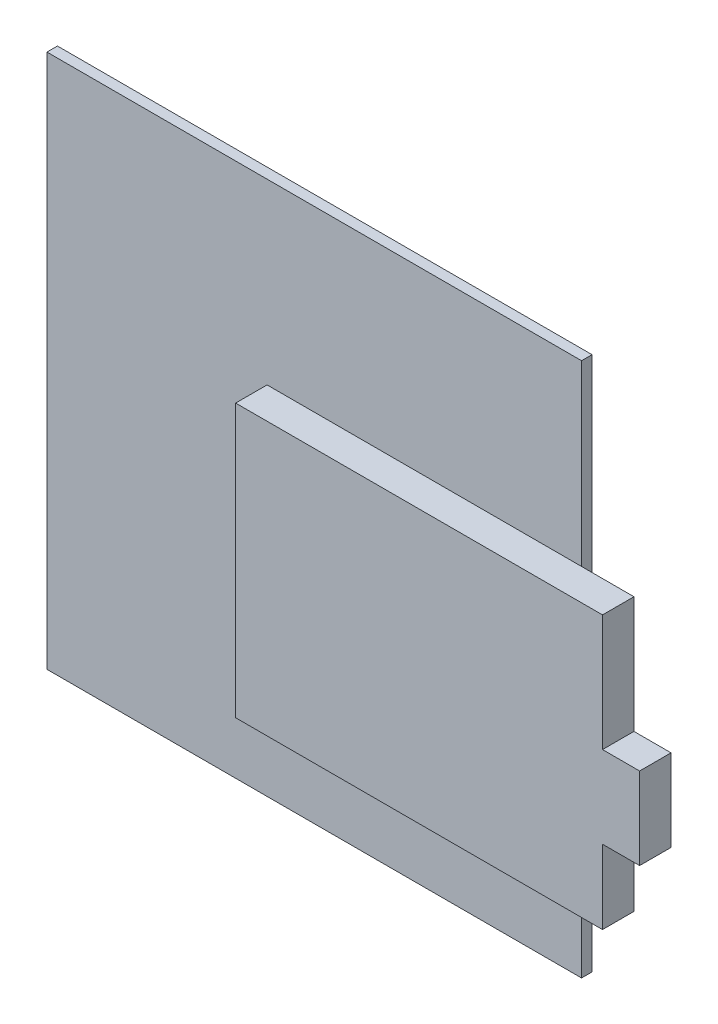
ISO-10303-21;
HEADER;
FILE_DESCRIPTION(('STEP AP214'),'2;1');
FILE_NAME('part.step','',(''),(''),'','','');
FILE_SCHEMA(('AUTOMOTIVE_DESIGN { 1 0 10303 214 1 1 1 1 }'));
ENDSEC;
DATA;
#1=APPLICATION_CONTEXT('core data for automotive mechanical design processes');
#2=APPLICATION_PROTOCOL_DEFINITION('international standard','automotive_design',2000,#1);
#3=PRODUCT_CONTEXT('',#1,'mechanical');
#4=PRODUCT('Part','Part','',(#3));
#5=PRODUCT_RELATED_PRODUCT_CATEGORY('part','',(#4));
#6=PRODUCT_DEFINITION_FORMATION('','',#4);
#7=PRODUCT_DEFINITION_CONTEXT('part definition',#1,'design');
#8=PRODUCT_DEFINITION('design','',#6,#7);
#9=PRODUCT_DEFINITION_SHAPE('','',#8);
#10=(LENGTH_UNIT() NAMED_UNIT(*) SI_UNIT(.MILLI.,.METRE.));
#11=(NAMED_UNIT(*) PLANE_ANGLE_UNIT() SI_UNIT($,.RADIAN.));
#12=(NAMED_UNIT(*) SI_UNIT($,.STERADIAN.) SOLID_ANGLE_UNIT());
#13=UNCERTAINTY_MEASURE_WITH_UNIT(LENGTH_MEASURE(1.E-05),#10,'distance_accuracy_value','');
#14=(GEOMETRIC_REPRESENTATION_CONTEXT(3) GLOBAL_UNCERTAINTY_ASSIGNED_CONTEXT((#13)) GLOBAL_UNIT_ASSIGNED_CONTEXT((#10,
#11,#12)) REPRESENTATION_CONTEXT('',''));
#15=CARTESIAN_POINT('',(0.,0.,0.));
#16=DIRECTION('',(0.,0.,1.));
#17=DIRECTION('',(1.,0.,0.));
#18=AXIS2_PLACEMENT_3D('',#15,#16,#17);
#19=CARTESIAN_POINT('',(0.,0.,1.));
#20=DIRECTION('',(1.,0.,0.));
#21=DIRECTION('',(0.,0.,-1.));
#22=AXIS2_PLACEMENT_3D('',#19,#20,#21);
#23=PLANE('',#22);
#24=DIRECTION('',(0.,-1.,0.));
#25=VECTOR('',#24,1.);
#26=CARTESIAN_POINT('',(0.,0.,1.));
#27=LINE('',#26,#25);
#28=CARTESIAN_POINT('',(0.,-1.,1.));
#29=VERTEX_POINT('',#28);
#30=CARTESIAN_POINT('',(0.,-52.,1.));
#31=VERTEX_POINT('',#30);
#32=EDGE_CURVE('E146',#29,#31,#27,.T.);
#33=ORIENTED_EDGE('',*,*,#32,.F.);
#34=DIRECTION('',(0.,0.,1.));
#35=VECTOR('',#34,1.);
#36=CARTESIAN_POINT('',(0.,-1.,-2.));
#37=LINE('',#36,#35);
#38=CARTESIAN_POINT('',(0.,-1.,0.));
#39=VERTEX_POINT('',#38);
#40=EDGE_CURVE('E134',#39,#29,#37,.T.);
#41=ORIENTED_EDGE('',*,*,#40,.F.);
#42=DIRECTION('',(0.,-1.,0.));
#43=VECTOR('',#42,1.);
#44=CARTESIAN_POINT('',(0.,0.,0.));
#45=LINE('',#44,#43);
#46=CARTESIAN_POINT('',(0.,-52.,0.));
#47=VERTEX_POINT('',#46);
#48=EDGE_CURVE('E175',#39,#47,#45,.T.);
#49=ORIENTED_EDGE('',*,*,#48,.T.);
#50=DIRECTION('',(0.,0.,-1.));
#51=VECTOR('',#50,1.);
#52=CARTESIAN_POINT('',(0.,-52.,1.));
#53=LINE('',#52,#51);
#54=EDGE_CURVE('E49',#31,#47,#53,.T.);
#55=ORIENTED_EDGE('',*,*,#54,.F.);
#56=EDGE_LOOP('',(#33,#41,#49,#55));
#57=FACE_BOUND('',#56,.T.);
#58=ADVANCED_FACE('F41',(#57),#23,.F.);
#59=CARTESIAN_POINT('',(0.,-52.,1.));
#60=DIRECTION('',(0.,1.,0.));
#61=DIRECTION('',(0.,0.,1.));
#62=AXIS2_PLACEMENT_3D('',#59,#60,#61);
#63=PLANE('',#62);
#64=DIRECTION('',(1.,0.,0.));
#65=VECTOR('',#64,1.);
#66=CARTESIAN_POINT('',(0.,-52.,0.));
#67=LINE('',#66,#65);
#68=CARTESIAN_POINT('',(51.,-52.,0.));
#69=VERTEX_POINT('',#68);
#70=EDGE_CURVE('E163',#47,#69,#67,.T.);
#71=ORIENTED_EDGE('',*,*,#70,.T.);
#72=DIRECTION('',(0.,0.,-1.));
#73=VECTOR('',#72,1.);
#74=CARTESIAN_POINT('',(51.,-52.,1.));
#75=LINE('',#74,#73);
#76=CARTESIAN_POINT('',(51.,-52.,1.));
#77=VERTEX_POINT('',#76);
#78=EDGE_CURVE('E173',#77,#69,#75,.T.);
#79=ORIENTED_EDGE('',*,*,#78,.F.);
#80=DIRECTION('',(1.,0.,0.));
#81=VECTOR('',#80,1.);
#82=CARTESIAN_POINT('',(0.,-52.,1.));
#83=LINE('',#82,#81);
#84=EDGE_CURVE('E156',#31,#77,#83,.T.);
#85=ORIENTED_EDGE('',*,*,#84,.F.);
#86=ORIENTED_EDGE('',*,*,#54,.T.);
#87=EDGE_LOOP('',(#71,#79,#85,#86));
#88=FACE_BOUND('',#87,.T.);
#89=ADVANCED_FACE('F184',(#88),#63,.F.);
#90=CARTESIAN_POINT('',(51.,0.,1.));
#91=DIRECTION('',(-1.,0.,0.));
#92=DIRECTION('',(0.,-1.,0.));
#93=AXIS2_PLACEMENT_3D('',#90,#91,#92);
#94=PLANE('',#93);
#95=DIRECTION('',(0.,1.,0.));
#96=VECTOR('',#95,1.);
#97=CARTESIAN_POINT('',(51.,0.,0.));
#98=LINE('',#97,#96);
#99=CARTESIAN_POINT('',(51.,-1.,0.));
#100=VERTEX_POINT('',#99);
#101=EDGE_CURVE('E157',#69,#100,#98,.T.);
#102=ORIENTED_EDGE('',*,*,#101,.T.);
#103=DIRECTION('',(0.,0.,1.));
#104=VECTOR('',#103,1.);
#105=CARTESIAN_POINT('',(51.,-1.,-2.));
#106=LINE('',#105,#104);
#107=CARTESIAN_POINT('',(51.,-1.,1.));
#108=VERTEX_POINT('',#107);
#109=EDGE_CURVE('E56',#100,#108,#106,.T.);
#110=ORIENTED_EDGE('',*,*,#109,.T.);
#111=DIRECTION('',(0.,1.,0.));
#112=VECTOR('',#111,1.);
#113=CARTESIAN_POINT('',(51.,0.,1.));
#114=LINE('',#113,#112);
#115=CARTESIAN_POINT('',(51.,-18.,1.));
#116=VERTEX_POINT('',#115);
#117=EDGE_CURVE('E150',#116,#108,#114,.T.);
#118=ORIENTED_EDGE('',*,*,#117,.F.);
#119=CARTESIAN_POINT('',(51.,-44.,1.));
#120=VERTEX_POINT('',#119);
#121=EDGE_CURVE('E174',#120,#116,#114,.T.);
#122=ORIENTED_EDGE('',*,*,#121,.F.);
#123=EDGE_CURVE('E169',#77,#120,#114,.T.);
#124=ORIENTED_EDGE('',*,*,#123,.F.);
#125=ORIENTED_EDGE('',*,*,#78,.T.);
#126=EDGE_LOOP('',(#102,#110,#118,#122,#124,#125));
#127=FACE_BOUND('',#126,.T.);
#128=ADVANCED_FACE('F194',(#127),#94,.F.);
#129=CARTESIAN_POINT('',(0.,0.,1.));
#130=DIRECTION('',(0.,0.,1.));
#131=DIRECTION('',(1.,0.,0.));
#132=AXIS2_PLACEMENT_3D('',#129,#130,#131);
#133=PLANE('',#132);
#134=DIRECTION('',(1.,0.,0.));
#135=VECTOR('',#134,1.);
#136=CARTESIAN_POINT('',(0.,-1.,1.));
#137=LINE('',#136,#135);
#138=EDGE_CURVE('E137',#29,#108,#137,.T.);
#139=ORIENTED_EDGE('',*,*,#138,.F.);
#140=ORIENTED_EDGE('',*,*,#32,.T.);
#141=ORIENTED_EDGE('',*,*,#84,.T.);
#142=ORIENTED_EDGE('',*,*,#123,.T.);
#143=DIRECTION('',(1.,0.,0.));
#144=VECTOR('',#143,1.);
#145=CARTESIAN_POINT('',(0.,-44.,1.));
#146=LINE('',#145,#144);
#147=CARTESIAN_POINT('',(21.,-44.,1.));
#148=VERTEX_POINT('',#147);
#149=EDGE_CURVE('E191',#148,#120,#146,.T.);
#150=ORIENTED_EDGE('',*,*,#149,.F.);
#151=DIRECTION('',(0.,-1.,0.));
#152=VECTOR('',#151,1.);
#153=CARTESIAN_POINT('',(21.,0.,1.));
#154=LINE('',#153,#152);
#155=CARTESIAN_POINT('',(21.,-18.,1.));
#156=VERTEX_POINT('',#155);
#157=EDGE_CURVE('E204',#156,#148,#154,.T.);
#158=ORIENTED_EDGE('',*,*,#157,.F.);
#159=DIRECTION('',(1.,0.,0.));
#160=VECTOR('',#159,1.);
#161=CARTESIAN_POINT('',(0.,-18.,1.));
#162=LINE('',#161,#160);
#163=EDGE_CURVE('E203',#156,#116,#162,.T.);
#164=ORIENTED_EDGE('',*,*,#163,.T.);
#165=ORIENTED_EDGE('',*,*,#117,.T.);
#166=EDGE_LOOP('',(#139,#140,#141,#142,#150,#158,#164,#165));
#167=FACE_BOUND('',#166,.T.);
#168=ADVANCED_FACE('F145',(#167),#133,.T.);
#169=CARTESIAN_POINT('',(0.,0.,0.));
#170=DIRECTION('',(0.,0.,1.));
#171=DIRECTION('',(1.,0.,0.));
#172=AXIS2_PLACEMENT_3D('',#169,#170,#171);
#173=PLANE('',#172);
#174=ORIENTED_EDGE('',*,*,#48,.F.);
#175=DIRECTION('',(1.,0.,0.));
#176=VECTOR('',#175,1.);
#177=CARTESIAN_POINT('',(0.,-1.,0.));
#178=LINE('',#177,#176);
#179=EDGE_CURVE('E11',#39,#100,#178,.T.);
#180=ORIENTED_EDGE('',*,*,#179,.T.);
#181=ORIENTED_EDGE('',*,*,#101,.F.);
#182=ORIENTED_EDGE('',*,*,#70,.F.);
#183=EDGE_LOOP('',(#174,#180,#181,#182));
#184=FACE_BOUND('',#183,.T.);
#185=ADVANCED_FACE('F299',(#184),#173,.F.);
#186=CARTESIAN_POINT('',(0.,0.,1.));
#187=DIRECTION('',(0.,0.,1.));
#188=DIRECTION('',(1.,0.,0.));
#189=AXIS2_PLACEMENT_3D('',#186,#187,#188);
#190=PLANE('',#189);
#191=CARTESIAN_POINT('',(56.,-44.,1.));
#192=VERTEX_POINT('',#191);
#193=EDGE_CURVE('E202',#120,#192,#146,.T.);
#194=ORIENTED_EDGE('',*,*,#193,.F.);
#195=ORIENTED_EDGE('',*,*,#121,.T.);
#196=CARTESIAN_POINT('',(56.,-18.,1.));
#197=VERTEX_POINT('',#196);
#198=EDGE_CURVE('E63',#116,#197,#162,.T.);
#199=ORIENTED_EDGE('',*,*,#198,.T.);
#200=DIRECTION('',(0.,-1.,0.));
#201=VECTOR('',#200,1.);
#202=CARTESIAN_POINT('',(56.,0.,1.));
#203=LINE('',#202,#201);
#204=CARTESIAN_POINT('',(56.,-29.1271766260461,1.));
#205=VERTEX_POINT('',#204);
#206=EDGE_CURVE('E210',#197,#205,#203,.T.);
#207=ORIENTED_EDGE('',*,*,#206,.T.);
#208=DIRECTION('',(1.,0.,0.));
#209=VECTOR('',#208,1.);
#210=CARTESIAN_POINT('',(0.,-29.1271766260461,1.));
#211=LINE('',#210,#209);
#212=CARTESIAN_POINT('',(59.538114814271,-29.1271766260461,1.));
#213=VERTEX_POINT('',#212);
#214=EDGE_CURVE('E212',#205,#213,#211,.T.);
#215=ORIENTED_EDGE('',*,*,#214,.T.);
#216=DIRECTION('',(0.,-1.,0.));
#217=VECTOR('',#216,1.);
#218=CARTESIAN_POINT('',(59.538114814271,0.,1.));
#219=LINE('',#218,#217);
#220=CARTESIAN_POINT('',(59.538114814271,-36.9451181911614,1.));
#221=VERTEX_POINT('',#220);
#222=EDGE_CURVE('E259',#213,#221,#219,.T.);
#223=ORIENTED_EDGE('',*,*,#222,.T.);
#224=DIRECTION('',(1.,0.,0.));
#225=VECTOR('',#224,1.);
#226=CARTESIAN_POINT('',(0.,-36.9451181911614,1.));
#227=LINE('',#226,#225);
#228=CARTESIAN_POINT('',(56.,-36.9451181911614,1.));
#229=VERTEX_POINT('',#228);
#230=EDGE_CURVE('E250',#229,#221,#227,.T.);
#231=ORIENTED_EDGE('',*,*,#230,.F.);
#232=EDGE_CURVE('E257',#229,#192,#203,.T.);
#233=ORIENTED_EDGE('',*,*,#232,.T.);
#234=EDGE_LOOP('',(#194,#195,#199,#207,#215,#223,#231,#233));
#235=FACE_BOUND('',#234,.T.);
#236=ADVANCED_FACE('F199',(#235),#190,.F.);
#237=CARTESIAN_POINT('',(56.,0.,4.));
#238=DIRECTION('',(1.,0.,0.));
#239=DIRECTION('',(0.,0.,-1.));
#240=AXIS2_PLACEMENT_3D('',#237,#238,#239);
#241=PLANE('',#240);
#242=ORIENTED_EDGE('',*,*,#232,.F.);
#243=DIRECTION('',(0.,0.,-1.));
#244=VECTOR('',#243,1.);
#245=CARTESIAN_POINT('',(56.,-36.9451181911614,4.));
#246=LINE('',#245,#244);
#247=CARTESIAN_POINT('',(56.,-36.9451181911614,4.));
#248=VERTEX_POINT('',#247);
#249=EDGE_CURVE('E166',#248,#229,#246,.T.);
#250=ORIENTED_EDGE('',*,*,#249,.F.);
#251=DIRECTION('',(0.,-1.,0.));
#252=VECTOR('',#251,1.);
#253=CARTESIAN_POINT('',(56.,0.,4.));
#254=LINE('',#253,#252);
#255=CARTESIAN_POINT('',(56.,-44.,4.));
#256=VERTEX_POINT('',#255);
#257=EDGE_CURVE('E217',#248,#256,#254,.T.);
#258=ORIENTED_EDGE('',*,*,#257,.T.);
#259=DIRECTION('',(0.,0.,-1.));
#260=VECTOR('',#259,1.);
#261=CARTESIAN_POINT('',(56.,-44.,4.));
#262=LINE('',#261,#260);
#263=EDGE_CURVE('E218',#256,#192,#262,.T.);
#264=ORIENTED_EDGE('',*,*,#263,.T.);
#265=EDGE_LOOP('',(#242,#250,#258,#264));
#266=FACE_BOUND('',#265,.T.);
#267=ADVANCED_FACE('F262',(#266),#241,.T.);
#268=CARTESIAN_POINT('',(0.,-36.9451181911614,4.));
#269=DIRECTION('',(0.,1.,0.));
#270=DIRECTION('',(0.,0.,1.));
#271=AXIS2_PLACEMENT_3D('',#268,#269,#270);
#272=PLANE('',#271);
#273=ORIENTED_EDGE('',*,*,#230,.T.);
#274=DIRECTION('',(0.,0.,-1.));
#275=VECTOR('',#274,1.);
#276=CARTESIAN_POINT('',(59.538114814271,-36.9451181911614,4.));
#277=LINE('',#276,#275);
#278=CARTESIAN_POINT('',(59.538114814271,-36.9451181911614,4.));
#279=VERTEX_POINT('',#278);
#280=EDGE_CURVE('E238',#279,#221,#277,.T.);
#281=ORIENTED_EDGE('',*,*,#280,.F.);
#282=DIRECTION('',(1.,0.,0.));
#283=VECTOR('',#282,1.);
#284=CARTESIAN_POINT('',(0.,-36.9451181911614,4.));
#285=LINE('',#284,#283);
#286=EDGE_CURVE('E252',#248,#279,#285,.T.);
#287=ORIENTED_EDGE('',*,*,#286,.F.);
#288=ORIENTED_EDGE('',*,*,#249,.T.);
#289=EDGE_LOOP('',(#273,#281,#287,#288));
#290=FACE_BOUND('',#289,.T.);
#291=ADVANCED_FACE('F249',(#290),#272,.F.);
#292=CARTESIAN_POINT('',(59.538114814271,0.,4.));
#293=DIRECTION('',(1.,0.,0.));
#294=DIRECTION('',(0.,0.,-1.));
#295=AXIS2_PLACEMENT_3D('',#292,#293,#294);
#296=PLANE('',#295);
#297=ORIENTED_EDGE('',*,*,#222,.F.);
#298=DIRECTION('',(0.,0.,-1.));
#299=VECTOR('',#298,1.);
#300=CARTESIAN_POINT('',(59.538114814271,-29.1271766260461,4.));
#301=LINE('',#300,#299);
#302=CARTESIAN_POINT('',(59.538114814271,-29.1271766260461,4.));
#303=VERTEX_POINT('',#302);
#304=EDGE_CURVE('E236',#303,#213,#301,.T.);
#305=ORIENTED_EDGE('',*,*,#304,.F.);
#306=DIRECTION('',(0.,-1.,0.));
#307=VECTOR('',#306,1.);
#308=CARTESIAN_POINT('',(59.538114814271,0.,4.));
#309=LINE('',#308,#307);
#310=EDGE_CURVE('E434',#303,#279,#309,.T.);
#311=ORIENTED_EDGE('',*,*,#310,.T.);
#312=ORIENTED_EDGE('',*,*,#280,.T.);
#313=EDGE_LOOP('',(#297,#305,#311,#312));
#314=FACE_BOUND('',#313,.T.);
#315=ADVANCED_FACE('F280',(#314),#296,.T.);
#316=CARTESIAN_POINT('',(0.,-29.1271766260461,4.));
#317=DIRECTION('',(0.,1.,0.));
#318=DIRECTION('',(0.,0.,1.));
#319=AXIS2_PLACEMENT_3D('',#316,#317,#318);
#320=PLANE('',#319);
#321=ORIENTED_EDGE('',*,*,#214,.F.);
#322=DIRECTION('',(0.,0.,-1.));
#323=VECTOR('',#322,1.);
#324=CARTESIAN_POINT('',(56.,-29.1271766260461,4.));
#325=LINE('',#324,#323);
#326=CARTESIAN_POINT('',(56.,-29.1271766260461,4.));
#327=VERTEX_POINT('',#326);
#328=EDGE_CURVE('E233',#327,#205,#325,.T.);
#329=ORIENTED_EDGE('',*,*,#328,.F.);
#330=DIRECTION('',(1.,0.,0.));
#331=VECTOR('',#330,1.);
#332=CARTESIAN_POINT('',(0.,-29.1271766260461,4.));
#333=LINE('',#332,#331);
#334=EDGE_CURVE('E278',#327,#303,#333,.T.);
#335=ORIENTED_EDGE('',*,*,#334,.T.);
#336=ORIENTED_EDGE('',*,*,#304,.T.);
#337=EDGE_LOOP('',(#321,#329,#335,#336));
#338=FACE_BOUND('',#337,.T.);
#339=ADVANCED_FACE('F275',(#338),#320,.T.);
#340=ORIENTED_EDGE('',*,*,#206,.F.);
#341=DIRECTION('',(0.,0.,-1.));
#342=VECTOR('',#341,1.);
#343=CARTESIAN_POINT('',(56.,-18.,4.));
#344=LINE('',#343,#342);
#345=CARTESIAN_POINT('',(56.,-18.,4.));
#346=VERTEX_POINT('',#345);
#347=EDGE_CURVE('E230',#346,#197,#344,.T.);
#348=ORIENTED_EDGE('',*,*,#347,.F.);
#349=EDGE_CURVE('E432',#346,#327,#254,.T.);
#350=ORIENTED_EDGE('',*,*,#349,.T.);
#351=ORIENTED_EDGE('',*,*,#328,.T.);
#352=EDGE_LOOP('',(#340,#348,#350,#351));
#353=FACE_BOUND('',#352,.T.);
#354=ADVANCED_FACE('F287',(#353),#241,.T.);
#355=CARTESIAN_POINT('',(0.,-18.,4.));
#356=DIRECTION('',(0.,1.,0.));
#357=DIRECTION('',(0.,0.,1.));
#358=AXIS2_PLACEMENT_3D('',#355,#356,#357);
#359=PLANE('',#358);
#360=ORIENTED_EDGE('',*,*,#163,.F.);
#361=DIRECTION('',(0.,0.,-1.));
#362=VECTOR('',#361,1.);
#363=CARTESIAN_POINT('',(21.,-18.,4.));
#364=LINE('',#363,#362);
#365=CARTESIAN_POINT('',(21.,-18.,4.));
#366=VERTEX_POINT('',#365);
#367=EDGE_CURVE('E227',#366,#156,#364,.T.);
#368=ORIENTED_EDGE('',*,*,#367,.F.);
#369=DIRECTION('',(1.,0.,0.));
#370=VECTOR('',#369,1.);
#371=CARTESIAN_POINT('',(0.,-18.,4.));
#372=LINE('',#371,#370);
#373=EDGE_CURVE('E438',#366,#346,#372,.T.);
#374=ORIENTED_EDGE('',*,*,#373,.T.);
#375=ORIENTED_EDGE('',*,*,#347,.T.);
#376=ORIENTED_EDGE('',*,*,#198,.F.);
#377=EDGE_LOOP('',(#360,#368,#374,#375,#376));
#378=FACE_BOUND('',#377,.T.);
#379=ADVANCED_FACE('F348',(#378),#359,.T.);
#380=CARTESIAN_POINT('',(21.,0.,4.));
#381=DIRECTION('',(1.,0.,0.));
#382=DIRECTION('',(0.,1.,0.));
#383=AXIS2_PLACEMENT_3D('',#380,#381,#382);
#384=PLANE('',#383);
#385=ORIENTED_EDGE('',*,*,#157,.T.);
#386=DIRECTION('',(0.,0.,-1.));
#387=VECTOR('',#386,1.);
#388=CARTESIAN_POINT('',(21.,-44.,4.));
#389=LINE('',#388,#387);
#390=CARTESIAN_POINT('',(21.,-44.,4.));
#391=VERTEX_POINT('',#390);
#392=EDGE_CURVE('E222',#391,#148,#389,.T.);
#393=ORIENTED_EDGE('',*,*,#392,.F.);
#394=DIRECTION('',(0.,-1.,0.));
#395=VECTOR('',#394,1.);
#396=CARTESIAN_POINT('',(21.,0.,4.));
#397=LINE('',#396,#395);
#398=EDGE_CURVE('E443',#366,#391,#397,.T.);
#399=ORIENTED_EDGE('',*,*,#398,.F.);
#400=ORIENTED_EDGE('',*,*,#367,.T.);
#401=EDGE_LOOP('',(#385,#393,#399,#400));
#402=FACE_BOUND('',#401,.T.);
#403=ADVANCED_FACE('F357',(#402),#384,.F.);
#404=CARTESIAN_POINT('',(0.,-44.,4.));
#405=DIRECTION('',(0.,1.,0.));
#406=DIRECTION('',(0.,0.,1.));
#407=AXIS2_PLACEMENT_3D('',#404,#405,#406);
#408=PLANE('',#407);
#409=ORIENTED_EDGE('',*,*,#149,.T.);
#410=ORIENTED_EDGE('',*,*,#193,.T.);
#411=ORIENTED_EDGE('',*,*,#263,.F.);
#412=DIRECTION('',(1.,0.,0.));
#413=VECTOR('',#412,1.);
#414=CARTESIAN_POINT('',(0.,-44.,4.));
#415=LINE('',#414,#413);
#416=EDGE_CURVE('E223',#391,#256,#415,.T.);
#417=ORIENTED_EDGE('',*,*,#416,.F.);
#418=ORIENTED_EDGE('',*,*,#392,.T.);
#419=EDGE_LOOP('',(#409,#410,#411,#417,#418));
#420=FACE_BOUND('',#419,.T.);
#421=ADVANCED_FACE('F366',(#420),#408,.F.);
#422=CARTESIAN_POINT('',(0.,0.,4.));
#423=DIRECTION('',(0.,0.,1.));
#424=DIRECTION('',(1.,0.,0.));
#425=AXIS2_PLACEMENT_3D('',#422,#423,#424);
#426=PLANE('',#425);
#427=ORIENTED_EDGE('',*,*,#257,.F.);
#428=ORIENTED_EDGE('',*,*,#286,.T.);
#429=ORIENTED_EDGE('',*,*,#310,.F.);
#430=ORIENTED_EDGE('',*,*,#334,.F.);
#431=ORIENTED_EDGE('',*,*,#349,.F.);
#432=ORIENTED_EDGE('',*,*,#373,.F.);
#433=ORIENTED_EDGE('',*,*,#398,.T.);
#434=ORIENTED_EDGE('',*,*,#416,.T.);
#435=EDGE_LOOP('',(#427,#428,#429,#430,#431,#432,#433,#434));
#436=FACE_BOUND('',#435,.T.);
#437=ADVANCED_FACE('F376',(#436),#426,.T.);
#438=CARTESIAN_POINT('',(0.,-1.,-2.));
#439=DIRECTION('',(0.,-1.,0.));
#440=DIRECTION('',(0.,0.,-1.));
#441=AXIS2_PLACEMENT_3D('',#438,#439,#440);
#442=PLANE('',#441);
#443=ORIENTED_EDGE('',*,*,#40,.T.);
#444=ORIENTED_EDGE('',*,*,#138,.T.);
#445=ORIENTED_EDGE('',*,*,#109,.F.);
#446=ORIENTED_EDGE('',*,*,#179,.F.);
#447=EDGE_LOOP('',(#443,#444,#445,#446));
#448=FACE_BOUND('',#447,.T.);
#449=ADVANCED_FACE('F136',(#448),#442,.F.);
#450=CLOSED_SHELL('',(#58,#89,#128,#168,#185,#236,#267,#291,#315,#339,#354,#379,#403,#421,#437,#449));
#451=MANIFOLD_SOLID_BREP('B2',#450);
#452=ADVANCED_BREP_SHAPE_REPRESENTATION('',(#18,#451),#14);
#453=SHAPE_DEFINITION_REPRESENTATION(#9,#452);
ENDSEC;
END-ISO-10303-21;
